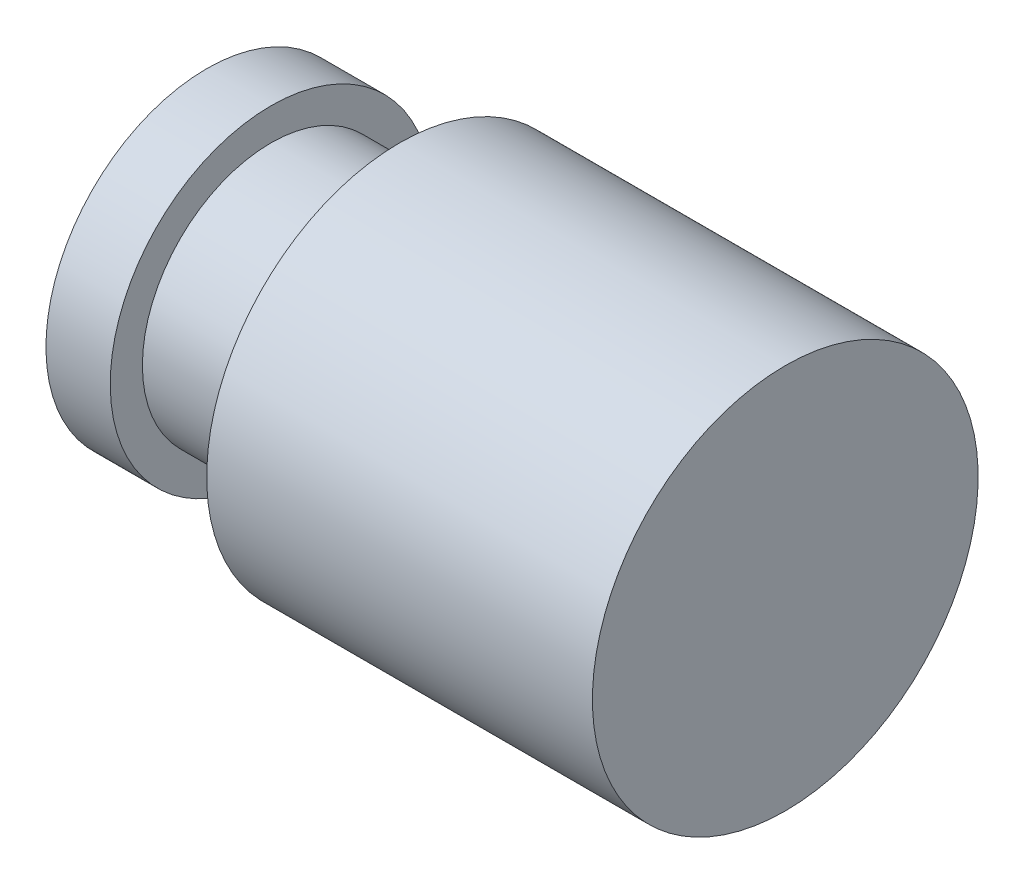
ISO-10303-21;
HEADER;
FILE_DESCRIPTION(('STEP AP214'),'2;1');
FILE_NAME('part.step','',(''),(''),'','','');
FILE_SCHEMA(('AUTOMOTIVE_DESIGN { 1 0 10303 214 1 1 1 1 }'));
ENDSEC;
DATA;
#1=APPLICATION_CONTEXT('core data for automotive mechanical design processes');
#2=APPLICATION_PROTOCOL_DEFINITION('international standard','automotive_design',2000,#1);
#3=PRODUCT_CONTEXT('',#1,'mechanical');
#4=PRODUCT('Part','Part','',(#3));
#5=PRODUCT_RELATED_PRODUCT_CATEGORY('part','',(#4));
#6=PRODUCT_DEFINITION_FORMATION('','',#4);
#7=PRODUCT_DEFINITION_CONTEXT('part definition',#1,'design');
#8=PRODUCT_DEFINITION('design','',#6,#7);
#9=PRODUCT_DEFINITION_SHAPE('','',#8);
#10=(LENGTH_UNIT() NAMED_UNIT(*) SI_UNIT(.MILLI.,.METRE.));
#11=(NAMED_UNIT(*) PLANE_ANGLE_UNIT() SI_UNIT($,.RADIAN.));
#12=(NAMED_UNIT(*) SI_UNIT($,.STERADIAN.) SOLID_ANGLE_UNIT());
#13=UNCERTAINTY_MEASURE_WITH_UNIT(LENGTH_MEASURE(1.E-05),#10,'distance_accuracy_value','');
#14=(GEOMETRIC_REPRESENTATION_CONTEXT(3) GLOBAL_UNCERTAINTY_ASSIGNED_CONTEXT((#13)) GLOBAL_UNIT_ASSIGNED_CONTEXT((#10,
#11,#12)) REPRESENTATION_CONTEXT('',''));
#15=CARTESIAN_POINT('',(0.,0.,0.));
#16=DIRECTION('',(0.,0.,1.));
#17=DIRECTION('',(1.,0.,0.));
#18=AXIS2_PLACEMENT_3D('',#15,#16,#17);
#19=CARTESIAN_POINT('',(0.,0.,0.));
#20=DIRECTION('',(-1.,0.,0.));
#21=DIRECTION('',(0.,-1.,0.));
#22=AXIS2_PLACEMENT_3D('',#19,#20,#21);
#23=PLANE('',#22);
#24=CARTESIAN_POINT('',(0.,0.,0.));
#25=DIRECTION('',(1.,0.,0.));
#26=DIRECTION('',(0.,1.,0.));
#27=AXIS2_PLACEMENT_3D('',#24,#25,#26);
#28=CIRCLE('',#27,2.5);
#29=CARTESIAN_POINT('',(0.,2.5,0.));
#30=VERTEX_POINT('',#29);
#31=EDGE_CURVE('E10',#30,#30,#28,.T.);
#32=ORIENTED_EDGE('',*,*,#31,.F.);
#33=EDGE_LOOP('',(#32));
#34=FACE_BOUND('',#33,.T.);
#35=ADVANCED_FACE('F36',(#34),#23,.T.);
#36=CARTESIAN_POINT('',(9.,0.,0.));
#37=DIRECTION('',(1.,0.,0.));
#38=DIRECTION('',(0.,1.,0.));
#39=AXIS2_PLACEMENT_3D('',#36,#37,#38);
#40=CYLINDRICAL_SURFACE('',#39,2.5);
#41=ORIENTED_EDGE('',*,*,#31,.T.);
#42=EDGE_LOOP('',(#41));
#43=FACE_BOUND('',#42,.T.);
#44=CARTESIAN_POINT('',(1.,0.,0.));
#45=DIRECTION('',(1.,0.,0.));
#46=DIRECTION('',(0.,1.,0.));
#47=AXIS2_PLACEMENT_3D('',#44,#45,#46);
#48=CIRCLE('',#47,2.5);
#49=CARTESIAN_POINT('',(1.,2.5,0.));
#50=VERTEX_POINT('',#49);
#51=EDGE_CURVE('E42',#50,#50,#48,.T.);
#52=ORIENTED_EDGE('',*,*,#51,.F.);
#53=EDGE_LOOP('',(#52));
#54=FACE_BOUND('',#53,.T.);
#55=ADVANCED_FACE('F78',(#43,#54),#40,.T.);
#56=CARTESIAN_POINT('',(1.,2.5,0.));
#57=DIRECTION('',(1.,0.,0.));
#58=DIRECTION('',(0.,1.,0.));
#59=AXIS2_PLACEMENT_3D('',#56,#57,#58);
#60=PLANE('',#59);
#61=ORIENTED_EDGE('',*,*,#51,.T.);
#62=EDGE_LOOP('',(#61));
#63=FACE_BOUND('',#62,.T.);
#64=CARTESIAN_POINT('',(1.,0.,0.));
#65=DIRECTION('',(1.,0.,0.));
#66=DIRECTION('',(0.,1.,0.));
#67=AXIS2_PLACEMENT_3D('',#64,#65,#66);
#68=CIRCLE('',#67,2.);
#69=CARTESIAN_POINT('',(1.,2.,0.));
#70=VERTEX_POINT('',#69);
#71=EDGE_CURVE('E46',#70,#70,#68,.T.);
#72=ORIENTED_EDGE('',*,*,#71,.F.);
#73=EDGE_LOOP('',(#72));
#74=FACE_BOUND('',#73,.T.);
#75=ADVANCED_FACE('F82',(#63,#74),#60,.T.);
#76=CARTESIAN_POINT('',(9.,0.,0.));
#77=DIRECTION('',(1.,0.,0.));
#78=DIRECTION('',(0.,1.,0.));
#79=AXIS2_PLACEMENT_3D('',#76,#77,#78);
#80=CYLINDRICAL_SURFACE('',#79,2.);
#81=ORIENTED_EDGE('',*,*,#71,.T.);
#82=EDGE_LOOP('',(#81));
#83=FACE_BOUND('',#82,.T.);
#84=CARTESIAN_POINT('',(3.,0.,0.));
#85=DIRECTION('',(1.,0.,0.));
#86=DIRECTION('',(0.,1.,0.));
#87=AXIS2_PLACEMENT_3D('',#84,#85,#86);
#88=CIRCLE('',#87,2.);
#89=CARTESIAN_POINT('',(3.,2.,0.));
#90=VERTEX_POINT('',#89);
#91=EDGE_CURVE('E50',#90,#90,#88,.T.);
#92=ORIENTED_EDGE('',*,*,#91,.F.);
#93=EDGE_LOOP('',(#92));
#94=FACE_BOUND('',#93,.T.);
#95=ADVANCED_FACE('F74',(#83,#94),#80,.T.);
#96=CARTESIAN_POINT('',(3.,2.,0.));
#97=DIRECTION('',(-1.,0.,0.));
#98=DIRECTION('',(0.,-1.,0.));
#99=AXIS2_PLACEMENT_3D('',#96,#97,#98);
#100=PLANE('',#99);
#101=ORIENTED_EDGE('',*,*,#91,.T.);
#102=EDGE_LOOP('',(#101));
#103=FACE_BOUND('',#102,.T.);
#104=CARTESIAN_POINT('',(3.,0.,0.));
#105=DIRECTION('',(1.,0.,0.));
#106=DIRECTION('',(0.,1.,0.));
#107=AXIS2_PLACEMENT_3D('',#104,#105,#106);
#108=CIRCLE('',#107,3.);
#109=CARTESIAN_POINT('',(3.,3.,0.));
#110=VERTEX_POINT('',#109);
#111=EDGE_CURVE('E55',#110,#110,#108,.T.);
#112=ORIENTED_EDGE('',*,*,#111,.F.);
#113=EDGE_LOOP('',(#112));
#114=FACE_BOUND('',#113,.T.);
#115=ADVANCED_FACE('F66',(#103,#114),#100,.T.);
#116=CARTESIAN_POINT('',(9.,0.,0.));
#117=DIRECTION('',(1.,0.,0.));
#118=DIRECTION('',(0.,1.,0.));
#119=AXIS2_PLACEMENT_3D('',#116,#117,#118);
#120=CYLINDRICAL_SURFACE('',#119,3.);
#121=ORIENTED_EDGE('',*,*,#111,.T.);
#122=EDGE_LOOP('',(#121));
#123=FACE_BOUND('',#122,.T.);
#124=CARTESIAN_POINT('',(9.,0.,0.));
#125=DIRECTION('',(1.,0.,0.));
#126=DIRECTION('',(0.,1.,0.));
#127=AXIS2_PLACEMENT_3D('',#124,#125,#126);
#128=CIRCLE('',#127,3.);
#129=CARTESIAN_POINT('',(9.,3.,0.));
#130=VERTEX_POINT('',#129);
#131=EDGE_CURVE('E58',#130,#130,#128,.T.);
#132=ORIENTED_EDGE('',*,*,#131,.F.);
#133=EDGE_LOOP('',(#132));
#134=FACE_BOUND('',#133,.T.);
#135=ADVANCED_FACE('F64',(#123,#134),#120,.T.);
#136=CARTESIAN_POINT('',(9.,2.,0.));
#137=DIRECTION('',(1.,0.,0.));
#138=DIRECTION('',(0.,1.,0.));
#139=AXIS2_PLACEMENT_3D('',#136,#137,#138);
#140=PLANE('',#139);
#141=ORIENTED_EDGE('',*,*,#131,.T.);
#142=EDGE_LOOP('',(#141));
#143=FACE_BOUND('',#142,.T.);
#144=ADVANCED_FACE('F62',(#143),#140,.T.);
#145=CLOSED_SHELL('',(#35,#55,#75,#95,#115,#135,#144));
#146=MANIFOLD_SOLID_BREP('B2',#145);
#147=ADVANCED_BREP_SHAPE_REPRESENTATION('',(#18,#146),#14);
#148=SHAPE_DEFINITION_REPRESENTATION(#9,#147);
ENDSEC;
END-ISO-10303-21;
